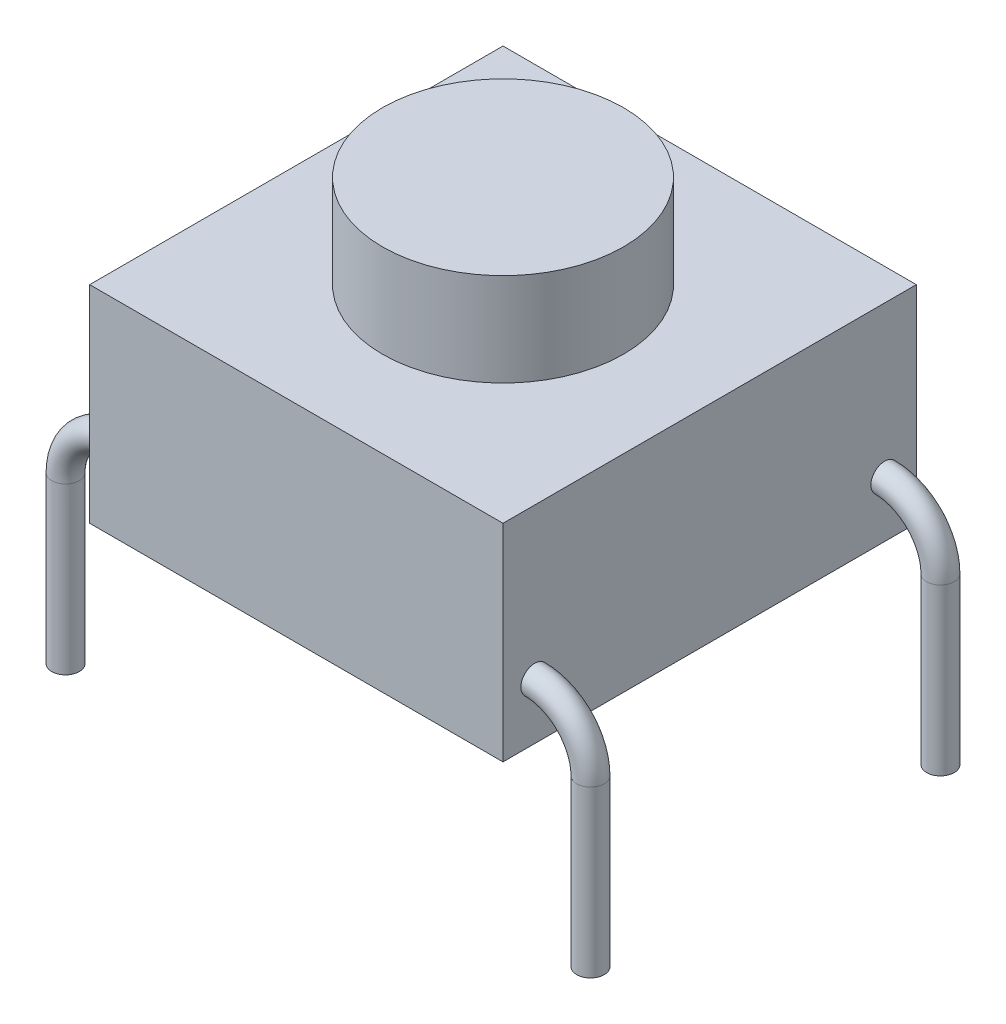
ISO-10303-21;
HEADER;
FILE_DESCRIPTION(('STEP AP214'),'2;1');
FILE_NAME('part.step','',(''),(''),'','','');
FILE_SCHEMA(('AUTOMOTIVE_DESIGN { 1 0 10303 214 1 1 1 1 }'));
ENDSEC;
DATA;
#1=APPLICATION_CONTEXT('core data for automotive mechanical design processes');
#2=APPLICATION_PROTOCOL_DEFINITION('international standard','automotive_design',2000,#1);
#3=PRODUCT_CONTEXT('',#1,'mechanical');
#4=PRODUCT('Part','Part','',(#3));
#5=PRODUCT_RELATED_PRODUCT_CATEGORY('part','',(#4));
#6=PRODUCT_DEFINITION_FORMATION('','',#4);
#7=PRODUCT_DEFINITION_CONTEXT('part definition',#1,'design');
#8=PRODUCT_DEFINITION('design','',#6,#7);
#9=PRODUCT_DEFINITION_SHAPE('','',#8);
#10=(LENGTH_UNIT() NAMED_UNIT(*) SI_UNIT(.MILLI.,.METRE.));
#11=(NAMED_UNIT(*) PLANE_ANGLE_UNIT() SI_UNIT($,.RADIAN.));
#12=(NAMED_UNIT(*) SI_UNIT($,.STERADIAN.) SOLID_ANGLE_UNIT());
#13=UNCERTAINTY_MEASURE_WITH_UNIT(LENGTH_MEASURE(1.E-05),#10,'distance_accuracy_value','');
#14=(GEOMETRIC_REPRESENTATION_CONTEXT(3) GLOBAL_UNCERTAINTY_ASSIGNED_CONTEXT((#13)) GLOBAL_UNIT_ASSIGNED_CONTEXT((#10,
#11,#12)) REPRESENTATION_CONTEXT('',''));
#15=CARTESIAN_POINT('',(0.,0.,0.));
#16=DIRECTION('',(0.,0.,1.));
#17=DIRECTION('',(1.,0.,0.));
#18=AXIS2_PLACEMENT_3D('',#15,#16,#17);
#19=CARTESIAN_POINT('',(-3.81,-2.4,-2.54));
#20=DIRECTION('',(0.,1.,0.));
#21=DIRECTION('',(0.,0.,1.));
#22=AXIS2_PLACEMENT_3D('',#19,#20,#21);
#23=CYLINDRICAL_SURFACE('',#22,0.2);
#24=CARTESIAN_POINT('',(-3.81,-2.4,-2.54));
#25=DIRECTION('',(0.,-1.,0.));
#26=DIRECTION('',(0.,0.,-1.));
#27=AXIS2_PLACEMENT_3D('',#24,#25,#26);
#28=CIRCLE('',#27,0.2);
#29=CARTESIAN_POINT('',(-3.81,-2.4,-2.74));
#30=VERTEX_POINT('',#29);
#31=EDGE_CURVE('E84',#30,#30,#28,.T.);
#32=ORIENTED_EDGE('',*,*,#31,.F.);
#33=EDGE_LOOP('',(#32));
#34=FACE_BOUND('',#33,.T.);
#35=CARTESIAN_POINT('',(-3.81,0.,-2.54));
#36=DIRECTION('',(0.,-1.,0.));
#37=DIRECTION('',(0.,0.,-1.));
#38=AXIS2_PLACEMENT_3D('',#35,#36,#37);
#39=CIRCLE('',#38,0.2);
#40=CARTESIAN_POINT('',(-3.81,0.,-2.74));
#41=VERTEX_POINT('',#40);
#42=EDGE_CURVE('E12',#41,#41,#39,.T.);
#43=ORIENTED_EDGE('',*,*,#42,.T.);
#44=EDGE_LOOP('',(#43));
#45=FACE_BOUND('',#44,.T.);
#46=ADVANCED_FACE('F80',(#34,#45),#23,.T.);
#47=CARTESIAN_POINT('',(-3.81,-2.4,-2.54));
#48=DIRECTION('',(0.,-1.,0.));
#49=DIRECTION('',(0.,0.,-1.));
#50=AXIS2_PLACEMENT_3D('',#47,#48,#49);
#51=PLANE('',#50);
#52=ORIENTED_EDGE('',*,*,#31,.T.);
#53=EDGE_LOOP('',(#52));
#54=FACE_BOUND('',#53,.T.);
#55=ADVANCED_FACE('F82',(#54),#51,.T.);
#56=CARTESIAN_POINT('',(-3.81,0.,-2.54));
#57=DIRECTION('',(0.,-1.,0.));
#58=DIRECTION('',(0.,0.,-1.));
#59=AXIS2_PLACEMENT_3D('',#56,#57,#58);
#60=PLANE('',#59);
#61=ORIENTED_EDGE('',*,*,#42,.F.);
#62=EDGE_LOOP('',(#61));
#63=FACE_BOUND('',#62,.T.);
#64=ADVANCED_FACE('F99',(#63),#60,.F.);
#65=CLOSED_SHELL('',(#46,#55,#64));
#66=MANIFOLD_SOLID_BREP('B2',#65);
#67=CARTESIAN_POINT('',(3.81,-2.4,-2.54));
#68=DIRECTION('',(0.,1.,0.));
#69=DIRECTION('',(0.,0.,1.));
#70=AXIS2_PLACEMENT_3D('',#67,#68,#69);
#71=CYLINDRICAL_SURFACE('',#70,0.200000000000001);
#72=CARTESIAN_POINT('',(3.81,-2.4,-2.54));
#73=DIRECTION('',(0.,-1.,0.));
#74=DIRECTION('',(0.,0.,-1.));
#75=AXIS2_PLACEMENT_3D('',#72,#73,#74);
#76=CIRCLE('',#75,0.200000000000001);
#77=CARTESIAN_POINT('',(3.81,-2.4,-2.74));
#78=VERTEX_POINT('',#77);
#79=EDGE_CURVE('E133',#78,#78,#76,.T.);
#80=ORIENTED_EDGE('',*,*,#79,.F.);
#81=EDGE_LOOP('',(#80));
#82=FACE_BOUND('',#81,.T.);
#83=CARTESIAN_POINT('',(3.81,0.,-2.54));
#84=DIRECTION('',(0.,-1.,0.));
#85=DIRECTION('',(0.,0.,-1.));
#86=AXIS2_PLACEMENT_3D('',#83,#84,#85);
#87=CIRCLE('',#86,0.200000000000001);
#88=CARTESIAN_POINT('',(3.81,0.,-2.74));
#89=VERTEX_POINT('',#88);
#90=EDGE_CURVE('E79',#89,#89,#87,.T.);
#91=ORIENTED_EDGE('',*,*,#90,.T.);
#92=EDGE_LOOP('',(#91));
#93=FACE_BOUND('',#92,.T.);
#94=ADVANCED_FACE('F129',(#82,#93),#71,.T.);
#95=CARTESIAN_POINT('',(3.81,-2.4,-2.54));
#96=DIRECTION('',(0.,-1.,0.));
#97=DIRECTION('',(0.,0.,-1.));
#98=AXIS2_PLACEMENT_3D('',#95,#96,#97);
#99=PLANE('',#98);
#100=ORIENTED_EDGE('',*,*,#79,.T.);
#101=EDGE_LOOP('',(#100));
#102=FACE_BOUND('',#101,.T.);
#103=ADVANCED_FACE('F131',(#102),#99,.T.);
#104=CARTESIAN_POINT('',(3.81,0.,-2.54));
#105=DIRECTION('',(0.,-1.,0.));
#106=DIRECTION('',(0.,0.,-1.));
#107=AXIS2_PLACEMENT_3D('',#104,#105,#106);
#108=PLANE('',#107);
#109=ORIENTED_EDGE('',*,*,#90,.F.);
#110=EDGE_LOOP('',(#109));
#111=FACE_BOUND('',#110,.T.);
#112=ADVANCED_FACE('F148',(#111),#108,.F.);
#113=CLOSED_SHELL('',(#94,#103,#112));
#114=MANIFOLD_SOLID_BREP('B7',#113);
#115=CARTESIAN_POINT('',(3.81,-2.4,2.54));
#116=DIRECTION('',(0.,1.,0.));
#117=DIRECTION('',(0.,0.,1.));
#118=AXIS2_PLACEMENT_3D('',#115,#116,#117);
#119=CYLINDRICAL_SURFACE('',#118,0.200000000000001);
#120=CARTESIAN_POINT('',(3.81,-2.4,2.54));
#121=DIRECTION('',(0.,-1.,0.));
#122=DIRECTION('',(0.,0.,-1.));
#123=AXIS2_PLACEMENT_3D('',#120,#121,#122);
#124=CIRCLE('',#123,0.200000000000001);
#125=CARTESIAN_POINT('',(3.81,-2.4,2.34));
#126=VERTEX_POINT('',#125);
#127=EDGE_CURVE('E183',#126,#126,#124,.T.);
#128=ORIENTED_EDGE('',*,*,#127,.F.);
#129=EDGE_LOOP('',(#128));
#130=FACE_BOUND('',#129,.T.);
#131=CARTESIAN_POINT('',(3.81,0.,2.54));
#132=DIRECTION('',(0.,-1.,0.));
#133=DIRECTION('',(0.,0.,-1.));
#134=AXIS2_PLACEMENT_3D('',#131,#132,#133);
#135=CIRCLE('',#134,0.200000000000001);
#136=CARTESIAN_POINT('',(3.81,0.,2.34));
#137=VERTEX_POINT('',#136);
#138=EDGE_CURVE('E128',#137,#137,#135,.T.);
#139=ORIENTED_EDGE('',*,*,#138,.T.);
#140=EDGE_LOOP('',(#139));
#141=FACE_BOUND('',#140,.T.);
#142=ADVANCED_FACE('F179',(#130,#141),#119,.T.);
#143=CARTESIAN_POINT('',(3.81,-2.4,2.54));
#144=DIRECTION('',(0.,-1.,0.));
#145=DIRECTION('',(0.,0.,-1.));
#146=AXIS2_PLACEMENT_3D('',#143,#144,#145);
#147=PLANE('',#146);
#148=ORIENTED_EDGE('',*,*,#127,.T.);
#149=EDGE_LOOP('',(#148));
#150=FACE_BOUND('',#149,.T.);
#151=ADVANCED_FACE('F181',(#150),#147,.T.);
#152=CARTESIAN_POINT('',(3.81,0.,2.54));
#153=DIRECTION('',(0.,-1.,0.));
#154=DIRECTION('',(0.,0.,-1.));
#155=AXIS2_PLACEMENT_3D('',#152,#153,#154);
#156=PLANE('',#155);
#157=ORIENTED_EDGE('',*,*,#138,.F.);
#158=EDGE_LOOP('',(#157));
#159=FACE_BOUND('',#158,.T.);
#160=ADVANCED_FACE('F198',(#159),#156,.F.);
#161=CLOSED_SHELL('',(#142,#151,#160));
#162=MANIFOLD_SOLID_BREP('B74',#161);
#163=CARTESIAN_POINT('',(-3.,3.,3.));
#164=DIRECTION('',(1.,0.,0.));
#165=DIRECTION('',(0.,0.,-1.));
#166=AXIS2_PLACEMENT_3D('',#163,#164,#165);
#167=PLANE('',#166);
#168=CARTESIAN_POINT('',(-3.,0.810000000000001,-2.54));
#169=DIRECTION('',(-1.,0.,0.));
#170=DIRECTION('',(0.,1.,0.));
#171=AXIS2_PLACEMENT_3D('',#168,#169,#170);
#172=CIRCLE('',#171,0.2);
#173=CARTESIAN_POINT('',(-3.,1.01,-2.54));
#174=VERTEX_POINT('',#173);
#175=EDGE_CURVE('E324',#174,#174,#172,.F.);
#176=ORIENTED_EDGE('',*,*,#175,.T.);
#177=EDGE_LOOP('',(#176));
#178=FACE_BOUND('',#177,.T.);
#179=CARTESIAN_POINT('',(-3.,0.810000000000001,2.54));
#180=DIRECTION('',(1.,0.,0.));
#181=DIRECTION('',(0.,1.,0.));
#182=AXIS2_PLACEMENT_3D('',#179,#180,#181);
#183=CIRCLE('',#182,0.2);
#184=CARTESIAN_POINT('',(-3.,1.01,2.54));
#185=VERTEX_POINT('',#184);
#186=EDGE_CURVE('E315',#185,#185,#183,.T.);
#187=ORIENTED_EDGE('',*,*,#186,.T.);
#188=EDGE_LOOP('',(#187));
#189=FACE_BOUND('',#188,.T.);
#190=DIRECTION('',(0.,0.,1.));
#191=VECTOR('',#190,1.);
#192=CARTESIAN_POINT('',(-3.,0.,3.));
#193=LINE('',#192,#191);
#194=CARTESIAN_POINT('',(-3.,0.,-3.));
#195=VERTEX_POINT('',#194);
#196=CARTESIAN_POINT('',(-3.,0.,3.));
#197=VERTEX_POINT('',#196);
#198=EDGE_CURVE('E291',#195,#197,#193,.T.);
#199=ORIENTED_EDGE('',*,*,#198,.T.);
#200=DIRECTION('',(0.,-1.,0.));
#201=VECTOR('',#200,1.);
#202=CARTESIAN_POINT('',(-3.,3.,3.));
#203=LINE('',#202,#201);
#204=CARTESIAN_POINT('',(-3.,3.,3.));
#205=VERTEX_POINT('',#204);
#206=EDGE_CURVE('E223',#205,#197,#203,.T.);
#207=ORIENTED_EDGE('',*,*,#206,.F.);
#208=DIRECTION('',(0.,0.,1.));
#209=VECTOR('',#208,1.);
#210=CARTESIAN_POINT('',(-3.,3.,3.));
#211=LINE('',#210,#209);
#212=CARTESIAN_POINT('',(-3.,3.,-3.));
#213=VERTEX_POINT('',#212);
#214=EDGE_CURVE('E274',#213,#205,#211,.T.);
#215=ORIENTED_EDGE('',*,*,#214,.F.);
#216=DIRECTION('',(0.,-1.,0.));
#217=VECTOR('',#216,1.);
#218=CARTESIAN_POINT('',(-3.,3.,-3.));
#219=LINE('',#218,#217);
#220=EDGE_CURVE('E287',#213,#195,#219,.T.);
#221=ORIENTED_EDGE('',*,*,#220,.T.);
#222=EDGE_LOOP('',(#199,#207,#215,#221));
#223=FACE_BOUND('',#222,.T.);
#224=ADVANCED_FACE('F220',(#178,#189,#223),#167,.F.);
#225=CARTESIAN_POINT('',(3.,3.,3.));
#226=DIRECTION('',(0.,0.,-1.));
#227=DIRECTION('',(-1.,0.,0.));
#228=AXIS2_PLACEMENT_3D('',#225,#226,#227);
#229=PLANE('',#228);
#230=DIRECTION('',(1.,0.,0.));
#231=VECTOR('',#230,1.);
#232=CARTESIAN_POINT('',(3.,0.,3.));
#233=LINE('',#232,#231);
#234=CARTESIAN_POINT('',(3.,0.,3.));
#235=VERTEX_POINT('',#234);
#236=EDGE_CURVE('E280',#197,#235,#233,.T.);
#237=ORIENTED_EDGE('',*,*,#236,.T.);
#238=DIRECTION('',(0.,-1.,0.));
#239=VECTOR('',#238,1.);
#240=CARTESIAN_POINT('',(3.,3.,3.));
#241=LINE('',#240,#239);
#242=CARTESIAN_POINT('',(3.,3.,3.));
#243=VERTEX_POINT('',#242);
#244=EDGE_CURVE('E278',#243,#235,#241,.T.);
#245=ORIENTED_EDGE('',*,*,#244,.F.);
#246=DIRECTION('',(1.,0.,0.));
#247=VECTOR('',#246,1.);
#248=CARTESIAN_POINT('',(3.,3.,3.));
#249=LINE('',#248,#247);
#250=EDGE_CURVE('E269',#205,#243,#249,.T.);
#251=ORIENTED_EDGE('',*,*,#250,.F.);
#252=ORIENTED_EDGE('',*,*,#206,.T.);
#253=EDGE_LOOP('',(#237,#245,#251,#252));
#254=FACE_BOUND('',#253,.T.);
#255=ADVANCED_FACE('F279',(#254),#229,.F.);
#256=CARTESIAN_POINT('',(3.,3.,3.));
#257=DIRECTION('',(-1.,0.,0.));
#258=DIRECTION('',(0.,0.,1.));
#259=AXIS2_PLACEMENT_3D('',#256,#257,#258);
#260=PLANE('',#259);
#261=CARTESIAN_POINT('',(3.,0.810000000000001,-2.54));
#262=DIRECTION('',(-1.,0.,0.));
#263=DIRECTION('',(0.,1.,0.));
#264=AXIS2_PLACEMENT_3D('',#261,#262,#263);
#265=CIRCLE('',#264,0.2);
#266=CARTESIAN_POINT('',(3.,1.01,-2.54));
#267=VERTEX_POINT('',#266);
#268=EDGE_CURVE('E343',#267,#267,#265,.T.);
#269=ORIENTED_EDGE('',*,*,#268,.T.);
#270=EDGE_LOOP('',(#269));
#271=FACE_BOUND('',#270,.T.);
#272=CARTESIAN_POINT('',(3.,0.810000000000001,2.54));
#273=DIRECTION('',(1.,0.,0.));
#274=DIRECTION('',(0.,1.,0.));
#275=AXIS2_PLACEMENT_3D('',#272,#273,#274);
#276=CIRCLE('',#275,0.2);
#277=CARTESIAN_POINT('',(3.,1.01,2.54));
#278=VERTEX_POINT('',#277);
#279=EDGE_CURVE('E335',#278,#278,#276,.F.);
#280=ORIENTED_EDGE('',*,*,#279,.T.);
#281=EDGE_LOOP('',(#280));
#282=FACE_BOUND('',#281,.T.);
#283=DIRECTION('',(0.,0.,-1.));
#284=VECTOR('',#283,1.);
#285=CARTESIAN_POINT('',(3.,0.,3.));
#286=LINE('',#285,#284);
#287=CARTESIAN_POINT('',(3.,0.,-3.));
#288=VERTEX_POINT('',#287);
#289=EDGE_CURVE('E255',#235,#288,#286,.T.);
#290=ORIENTED_EDGE('',*,*,#289,.T.);
#291=DIRECTION('',(0.,-1.,0.));
#292=VECTOR('',#291,1.);
#293=CARTESIAN_POINT('',(3.,3.,-3.));
#294=LINE('',#293,#292);
#295=CARTESIAN_POINT('',(3.,3.,-3.));
#296=VERTEX_POINT('',#295);
#297=EDGE_CURVE('E282',#296,#288,#294,.T.);
#298=ORIENTED_EDGE('',*,*,#297,.F.);
#299=DIRECTION('',(0.,0.,-1.));
#300=VECTOR('',#299,1.);
#301=CARTESIAN_POINT('',(3.,3.,3.));
#302=LINE('',#301,#300);
#303=EDGE_CURVE('E272',#243,#296,#302,.T.);
#304=ORIENTED_EDGE('',*,*,#303,.F.);
#305=ORIENTED_EDGE('',*,*,#244,.T.);
#306=EDGE_LOOP('',(#290,#298,#304,#305));
#307=FACE_BOUND('',#306,.T.);
#308=ADVANCED_FACE('F283',(#271,#282,#307),#260,.F.);
#309=CARTESIAN_POINT('',(3.,3.,-3.));
#310=DIRECTION('',(0.,0.,1.));
#311=DIRECTION('',(1.,0.,0.));
#312=AXIS2_PLACEMENT_3D('',#309,#310,#311);
#313=PLANE('',#312);
#314=DIRECTION('',(-1.,0.,0.));
#315=VECTOR('',#314,1.);
#316=CARTESIAN_POINT('',(3.,0.,-3.));
#317=LINE('',#316,#315);
#318=EDGE_CURVE('E261',#288,#195,#317,.T.);
#319=ORIENTED_EDGE('',*,*,#318,.T.);
#320=ORIENTED_EDGE('',*,*,#220,.F.);
#321=DIRECTION('',(-1.,0.,0.));
#322=VECTOR('',#321,1.);
#323=CARTESIAN_POINT('',(3.,3.,-3.));
#324=LINE('',#323,#322);
#325=EDGE_CURVE('E238',#296,#213,#324,.T.);
#326=ORIENTED_EDGE('',*,*,#325,.F.);
#327=ORIENTED_EDGE('',*,*,#297,.T.);
#328=EDGE_LOOP('',(#319,#320,#326,#327));
#329=FACE_BOUND('',#328,.T.);
#330=ADVANCED_FACE('F305',(#329),#313,.F.);
#331=CARTESIAN_POINT('',(0.,3.,0.));
#332=DIRECTION('',(0.,1.,0.));
#333=DIRECTION('',(0.,0.,1.));
#334=AXIS2_PLACEMENT_3D('',#331,#332,#333);
#335=PLANE('',#334);
#336=CARTESIAN_POINT('',(0.,3.,0.));
#337=DIRECTION('',(0.,1.,0.));
#338=DIRECTION('',(0.,0.,1.));
#339=AXIS2_PLACEMENT_3D('',#336,#337,#338);
#340=CIRCLE('',#339,1.75);
#341=CARTESIAN_POINT('',(0.,3.,1.75));
#342=VERTEX_POINT('',#341);
#343=EDGE_CURVE('E177',#342,#342,#340,.T.);
#344=ORIENTED_EDGE('',*,*,#343,.F.);
#345=EDGE_LOOP('',(#344));
#346=FACE_BOUND('',#345,.T.);
#347=ORIENTED_EDGE('',*,*,#214,.T.);
#348=ORIENTED_EDGE('',*,*,#250,.T.);
#349=ORIENTED_EDGE('',*,*,#303,.T.);
#350=ORIENTED_EDGE('',*,*,#325,.T.);
#351=EDGE_LOOP('',(#347,#348,#349,#350));
#352=FACE_BOUND('',#351,.T.);
#353=ADVANCED_FACE('F270',(#346,#352),#335,.T.);
#354=CARTESIAN_POINT('',(0.,0.,0.));
#355=DIRECTION('',(0.,1.,0.));
#356=DIRECTION('',(0.,0.,1.));
#357=AXIS2_PLACEMENT_3D('',#354,#355,#356);
#358=PLANE('',#357);
#359=ORIENTED_EDGE('',*,*,#198,.F.);
#360=ORIENTED_EDGE('',*,*,#318,.F.);
#361=ORIENTED_EDGE('',*,*,#289,.F.);
#362=ORIENTED_EDGE('',*,*,#236,.F.);
#363=EDGE_LOOP('',(#359,#360,#361,#362));
#364=FACE_BOUND('',#363,.T.);
#365=ADVANCED_FACE('F308',(#364),#358,.F.);
#366=CARTESIAN_POINT('',(0.,4.35,0.));
#367=DIRECTION('',(0.,-1.,0.));
#368=DIRECTION('',(0.,0.,-1.));
#369=AXIS2_PLACEMENT_3D('',#366,#367,#368);
#370=CYLINDRICAL_SURFACE('',#369,1.75);
#371=CARTESIAN_POINT('',(0.,4.35,0.));
#372=DIRECTION('',(0.,1.,0.));
#373=DIRECTION('',(0.,0.,1.));
#374=AXIS2_PLACEMENT_3D('',#371,#372,#373);
#375=CIRCLE('',#374,1.75);
#376=CARTESIAN_POINT('',(0.,4.35,1.75));
#377=VERTEX_POINT('',#376);
#378=EDGE_CURVE('E295',#377,#377,#375,.T.);
#379=ORIENTED_EDGE('',*,*,#378,.F.);
#380=EDGE_LOOP('',(#379));
#381=FACE_BOUND('',#380,.T.);
#382=ORIENTED_EDGE('',*,*,#343,.T.);
#383=EDGE_LOOP('',(#382));
#384=FACE_BOUND('',#383,.T.);
#385=ADVANCED_FACE('F401',(#381,#384),#370,.T.);
#386=CARTESIAN_POINT('',(0.,4.35,0.));
#387=DIRECTION('',(0.,1.,0.));
#388=DIRECTION('',(0.,0.,1.));
#389=AXIS2_PLACEMENT_3D('',#386,#387,#388);
#390=PLANE('',#389);
#391=ORIENTED_EDGE('',*,*,#378,.T.);
#392=EDGE_LOOP('',(#391));
#393=FACE_BOUND('',#392,.T.);
#394=ADVANCED_FACE('F381',(#393),#390,.T.);
#395=CARTESIAN_POINT('',(-3.,0.,2.54));
#396=DIRECTION('',(0.,0.,-1.));
#397=DIRECTION('',(-1.,0.,0.));
#398=AXIS2_PLACEMENT_3D('',#395,#396,#397);
#399=TOROIDAL_SURFACE('',#398,0.810000000000001,0.2);
#400=CARTESIAN_POINT('',(-3.81,0.,2.54));
#401=DIRECTION('',(0.,-1.,0.));
#402=DIRECTION('',(0.,0.,-1.));
#403=AXIS2_PLACEMENT_3D('',#400,#401,#402);
#404=CIRCLE('',#403,0.2);
#405=CARTESIAN_POINT('',(-4.01,0.,2.54));
#406=VERTEX_POINT('',#405);
#407=EDGE_CURVE('E320',#406,#406,#404,.T.);
#408=CARTESIAN_POINT('',(-3.,0.,2.54));
#409=DIRECTION('',(0.,0.,-1.));
#410=DIRECTION('',(-1.,0.,0.));
#411=AXIS2_PLACEMENT_3D('',#408,#409,#410);
#412=CIRCLE('',#411,1.01);
#413=EDGE_CURVE('',#406,#185,#412,.T.);
#414=ORIENTED_EDGE('',*,*,#407,.F.);
#415=ORIENTED_EDGE('',*,*,#186,.F.);
#416=ORIENTED_EDGE('',*,*,#413,.T.);
#417=ORIENTED_EDGE('',*,*,#413,.F.);
#418=EDGE_LOOP('',(#414,#416,#415,#417));
#419=FACE_BOUND('',#418,.T.);
#420=ADVANCED_FACE('F377',(#419),#399,.T.);
#421=CARTESIAN_POINT('',(-3.81,-2.4,2.54));
#422=DIRECTION('',(0.,1.,0.));
#423=DIRECTION('',(0.,0.,1.));
#424=AXIS2_PLACEMENT_3D('',#421,#422,#423);
#425=CYLINDRICAL_SURFACE('',#424,0.2);
#426=CARTESIAN_POINT('',(-3.81,-2.4,2.54));
#427=DIRECTION('',(0.,-1.,0.));
#428=DIRECTION('',(0.,0.,-1.));
#429=AXIS2_PLACEMENT_3D('',#426,#427,#428);
#430=CIRCLE('',#429,0.2);
#431=CARTESIAN_POINT('',(-3.81,-2.4,2.34));
#432=VERTEX_POINT('',#431);
#433=EDGE_CURVE('E319',#432,#432,#430,.T.);
#434=ORIENTED_EDGE('',*,*,#433,.F.);
#435=EDGE_LOOP('',(#434));
#436=FACE_BOUND('',#435,.T.);
#437=ORIENTED_EDGE('',*,*,#407,.T.);
#438=EDGE_LOOP('',(#437));
#439=FACE_BOUND('',#438,.T.);
#440=ADVANCED_FACE('F380',(#436,#439),#425,.T.);
#441=CARTESIAN_POINT('',(-3.81,-2.4,2.54));
#442=DIRECTION('',(0.,-1.,0.));
#443=DIRECTION('',(0.,0.,-1.));
#444=AXIS2_PLACEMENT_3D('',#441,#442,#443);
#445=PLANE('',#444);
#446=ORIENTED_EDGE('',*,*,#433,.T.);
#447=EDGE_LOOP('',(#446));
#448=FACE_BOUND('',#447,.T.);
#449=ADVANCED_FACE('F386',(#448),#445,.T.);
#450=CARTESIAN_POINT('',(-3.81,0.,-2.54));
#451=DIRECTION('',(0.,1.,0.));
#452=DIRECTION('',(-1.,0.,0.));
#453=AXIS2_PLACEMENT_3D('',#450,#451,#452);
#454=PLANE('',#453);
#455=CARTESIAN_POINT('',(-3.81,0.,-2.54));
#456=DIRECTION('',(0.,-1.,0.));
#457=DIRECTION('',(-1.,0.,0.));
#458=AXIS2_PLACEMENT_3D('',#455,#456,#457);
#459=CIRCLE('',#458,0.2);
#460=CARTESIAN_POINT('',(-4.01,0.,-2.54));
#461=VERTEX_POINT('',#460);
#462=EDGE_CURVE('E331',#461,#461,#459,.F.);
#463=ORIENTED_EDGE('',*,*,#462,.F.);
#464=EDGE_LOOP('',(#463));
#465=FACE_BOUND('',#464,.T.);
#466=ADVANCED_FACE('F367',(#465),#454,.F.);
#467=CARTESIAN_POINT('',(-3.,0.,-2.54));
#468=DIRECTION('',(0.,0.,-1.));
#469=DIRECTION('',(-1.,0.,0.));
#470=AXIS2_PLACEMENT_3D('',#467,#468,#469);
#471=TOROIDAL_SURFACE('',#470,0.810000000000001,0.2);
#472=CARTESIAN_POINT('',(-3.,0.,-2.54));
#473=DIRECTION('',(0.,0.,-1.));
#474=DIRECTION('',(-1.,0.,0.));
#475=AXIS2_PLACEMENT_3D('',#472,#473,#474);
#476=CIRCLE('',#475,1.01);
#477=EDGE_CURVE('',#461,#174,#476,.T.);
#478=ORIENTED_EDGE('',*,*,#462,.T.);
#479=ORIENTED_EDGE('',*,*,#175,.F.);
#480=ORIENTED_EDGE('',*,*,#477,.T.);
#481=ORIENTED_EDGE('',*,*,#477,.F.);
#482=EDGE_LOOP('',(#478,#480,#479,#481));
#483=FACE_BOUND('',#482,.T.);
#484=ADVANCED_FACE('F395',(#483),#471,.T.);
#485=CARTESIAN_POINT('',(3.81,0.,2.54));
#486=DIRECTION('',(0.,1.,0.));
#487=DIRECTION('',(1.,0.,0.));
#488=AXIS2_PLACEMENT_3D('',#485,#486,#487);
#489=PLANE('',#488);
#490=CARTESIAN_POINT('',(3.81,0.,2.54));
#491=DIRECTION('',(0.,-1.,0.));
#492=DIRECTION('',(1.,0.,0.));
#493=AXIS2_PLACEMENT_3D('',#490,#491,#492);
#494=CIRCLE('',#493,0.2);
#495=CARTESIAN_POINT('',(4.01,0.,2.54));
#496=VERTEX_POINT('',#495);
#497=EDGE_CURVE('E339',#496,#496,#494,.F.);
#498=ORIENTED_EDGE('',*,*,#497,.F.);
#499=EDGE_LOOP('',(#498));
#500=FACE_BOUND('',#499,.T.);
#501=ADVANCED_FACE('F364',(#500),#489,.F.);
#502=CARTESIAN_POINT('',(3.,0.,2.54));
#503=DIRECTION('',(0.,0.,1.));
#504=DIRECTION('',(1.,0.,0.));
#505=AXIS2_PLACEMENT_3D('',#502,#503,#504);
#506=TOROIDAL_SURFACE('',#505,0.810000000000001,0.2);
#507=CARTESIAN_POINT('',(3.,0.,2.54));
#508=DIRECTION('',(0.,0.,1.));
#509=DIRECTION('',(1.,0.,0.));
#510=AXIS2_PLACEMENT_3D('',#507,#508,#509);
#511=CIRCLE('',#510,1.01);
#512=EDGE_CURVE('',#496,#278,#511,.T.);
#513=ORIENTED_EDGE('',*,*,#497,.T.);
#514=ORIENTED_EDGE('',*,*,#279,.F.);
#515=ORIENTED_EDGE('',*,*,#512,.T.);
#516=ORIENTED_EDGE('',*,*,#512,.F.);
#517=EDGE_LOOP('',(#513,#515,#514,#516));
#518=FACE_BOUND('',#517,.T.);
#519=ADVANCED_FACE('F356',(#518),#506,.T.);
#520=CARTESIAN_POINT('',(3.81,0.,-2.54));
#521=DIRECTION('',(0.,1.,0.));
#522=DIRECTION('',(1.,0.,0.));
#523=AXIS2_PLACEMENT_3D('',#520,#521,#522);
#524=PLANE('',#523);
#525=CARTESIAN_POINT('',(3.81,0.,-2.54));
#526=DIRECTION('',(0.,1.,0.));
#527=DIRECTION('',(1.,0.,0.));
#528=AXIS2_PLACEMENT_3D('',#525,#526,#527);
#529=CIRCLE('',#528,0.2);
#530=CARTESIAN_POINT('',(4.01,0.,-2.54));
#531=VERTEX_POINT('',#530);
#532=EDGE_CURVE('E347',#531,#531,#529,.T.);
#533=ORIENTED_EDGE('',*,*,#532,.F.);
#534=EDGE_LOOP('',(#533));
#535=FACE_BOUND('',#534,.T.);
#536=ADVANCED_FACE('F354',(#535),#524,.F.);
#537=CARTESIAN_POINT('',(3.,0.,-2.54));
#538=DIRECTION('',(0.,0.,1.));
#539=DIRECTION('',(1.,0.,0.));
#540=AXIS2_PLACEMENT_3D('',#537,#538,#539);
#541=TOROIDAL_SURFACE('',#540,0.810000000000001,0.2);
#542=CARTESIAN_POINT('',(3.,0.,-2.54));
#543=DIRECTION('',(0.,0.,1.));
#544=DIRECTION('',(1.,0.,0.));
#545=AXIS2_PLACEMENT_3D('',#542,#543,#544);
#546=CIRCLE('',#545,1.01);
#547=EDGE_CURVE('',#531,#267,#546,.T.);
#548=ORIENTED_EDGE('',*,*,#532,.T.);
#549=ORIENTED_EDGE('',*,*,#268,.F.);
#550=ORIENTED_EDGE('',*,*,#547,.T.);
#551=ORIENTED_EDGE('',*,*,#547,.F.);
#552=EDGE_LOOP('',(#548,#550,#549,#551));
#553=FACE_BOUND('',#552,.T.);
#554=ADVANCED_FACE('F352',(#553),#541,.T.);
#555=CLOSED_SHELL('',(#224,#255,#308,#330,#353,#365,#385,#394,#420,#440,#449,#466,#484,#501,
#519,#536,#554));
#556=MANIFOLD_SOLID_BREP('B123',#555);
#557=ADVANCED_BREP_SHAPE_REPRESENTATION('',(#18,#66,#114,#162,#556),#14);
#558=SHAPE_DEFINITION_REPRESENTATION(#9,#557);
ENDSEC;
END-ISO-10303-21;
